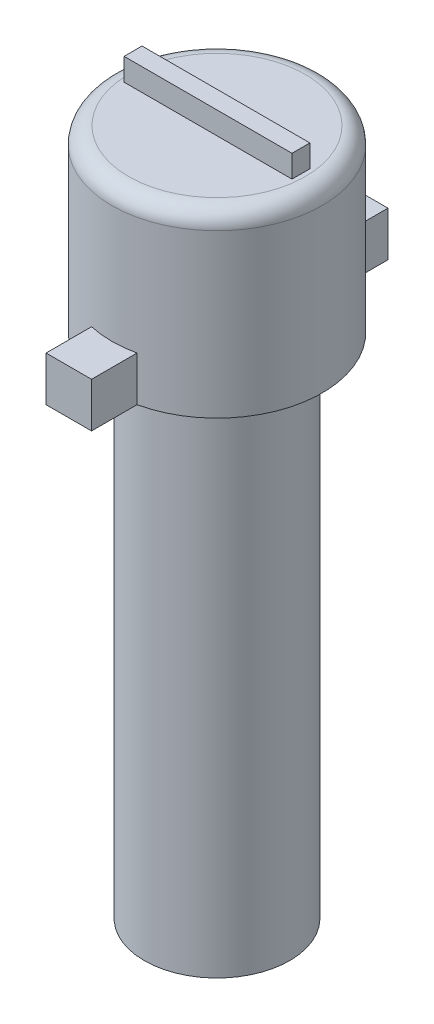
ISO-10303-21;
HEADER;
FILE_DESCRIPTION(('STEP AP214'),'2;1');
FILE_NAME('part.step','',(''),(''),'','','');
FILE_SCHEMA(('AUTOMOTIVE_DESIGN { 1 0 10303 214 1 1 1 1 }'));
ENDSEC;
DATA;
#1=APPLICATION_CONTEXT('core data for automotive mechanical design processes');
#2=APPLICATION_PROTOCOL_DEFINITION('international standard','automotive_design',2000,#1);
#3=PRODUCT_CONTEXT('',#1,'mechanical');
#4=PRODUCT('Part','Part','',(#3));
#5=PRODUCT_RELATED_PRODUCT_CATEGORY('part','',(#4));
#6=PRODUCT_DEFINITION_FORMATION('','',#4);
#7=PRODUCT_DEFINITION_CONTEXT('part definition',#1,'design');
#8=PRODUCT_DEFINITION('design','',#6,#7);
#9=PRODUCT_DEFINITION_SHAPE('','',#8);
#10=(LENGTH_UNIT() NAMED_UNIT(*) SI_UNIT(.MILLI.,.METRE.));
#11=(NAMED_UNIT(*) PLANE_ANGLE_UNIT() SI_UNIT($,.RADIAN.));
#12=(NAMED_UNIT(*) SI_UNIT($,.STERADIAN.) SOLID_ANGLE_UNIT());
#13=UNCERTAINTY_MEASURE_WITH_UNIT(LENGTH_MEASURE(1.E-05),#10,'distance_accuracy_value','');
#14=(GEOMETRIC_REPRESENTATION_CONTEXT(3) GLOBAL_UNCERTAINTY_ASSIGNED_CONTEXT((#13)) GLOBAL_UNIT_ASSIGNED_CONTEXT((#10,
#11,#12)) REPRESENTATION_CONTEXT('',''));
#15=CARTESIAN_POINT('',(0.,0.,0.));
#16=DIRECTION('',(0.,0.,1.));
#17=DIRECTION('',(1.,0.,0.));
#18=AXIS2_PLACEMENT_3D('',#15,#16,#17);
#19=CARTESIAN_POINT('',(0.,30.686,0.));
#20=DIRECTION('',(0.,-1.,0.));
#21=DIRECTION('',(0.,0.,-1.));
#22=AXIS2_PLACEMENT_3D('',#19,#20,#21);
#23=CYLINDRICAL_SURFACE('',#22,4.7);
#24=CARTESIAN_POINT('',(0.,29.936,0.));
#25=DIRECTION('',(0.,1.,0.));
#26=DIRECTION('',(0.,0.,1.));
#27=AXIS2_PLACEMENT_3D('',#24,#25,#26);
#28=CIRCLE('',#27,4.7);
#29=CARTESIAN_POINT('',(0.,29.936,4.7));
#30=VERTEX_POINT('',#29);
#31=EDGE_CURVE('E12',#30,#30,#28,.F.);
#32=ORIENTED_EDGE('',*,*,#31,.T.);
#33=EDGE_LOOP('',(#32));
#34=FACE_BOUND('',#33,.T.);
#35=DIRECTION('',(0.,-1.,0.));
#36=VECTOR('',#35,1.);
#37=CARTESIAN_POINT('',(1.016,24.686,4.58887175676113));
#38=LINE('',#37,#36);
#39=CARTESIAN_POINT('',(1.016,24.686,4.58887175676113));
#40=VERTEX_POINT('',#39);
#41=CARTESIAN_POINT('',(1.016,22.686,4.58887175676113));
#42=VERTEX_POINT('',#41);
#43=EDGE_CURVE('E179',#40,#42,#38,.T.);
#44=ORIENTED_EDGE('',*,*,#43,.T.);
#45=CARTESIAN_POINT('',(0.,22.686,0.));
#46=DIRECTION('',(0.,1.,0.));
#47=DIRECTION('',(0.,0.,1.));
#48=AXIS2_PLACEMENT_3D('',#45,#46,#47);
#49=CIRCLE('',#48,4.7);
#50=CARTESIAN_POINT('',(1.016,22.686,-4.58887175676113));
#51=VERTEX_POINT('',#50);
#52=EDGE_CURVE('E288',#42,#51,#49,.T.);
#53=ORIENTED_EDGE('',*,*,#52,.T.);
#54=DIRECTION('',(0.,-1.,0.));
#55=VECTOR('',#54,1.);
#56=CARTESIAN_POINT('',(1.016,24.686,-4.58887175676113));
#57=LINE('',#56,#55);
#58=CARTESIAN_POINT('',(1.016,24.686,-4.58887175676113));
#59=VERTEX_POINT('',#58);
#60=EDGE_CURVE('E193',#59,#51,#57,.T.);
#61=ORIENTED_EDGE('',*,*,#60,.F.);
#62=CARTESIAN_POINT('',(0.,24.686,0.));
#63=DIRECTION('',(0.,-1.,0.));
#64=DIRECTION('',(0.,0.,-1.));
#65=AXIS2_PLACEMENT_3D('',#62,#63,#64);
#66=CIRCLE('',#65,4.7);
#67=CARTESIAN_POINT('',(-1.016,24.686,-4.58887175676113));
#68=VERTEX_POINT('',#67);
#69=EDGE_CURVE('E203',#68,#59,#66,.T.);
#70=ORIENTED_EDGE('',*,*,#69,.F.);
#71=DIRECTION('',(0.,-1.,0.));
#72=VECTOR('',#71,1.);
#73=CARTESIAN_POINT('',(-1.016,24.686,-4.58887175676113));
#74=LINE('',#73,#72);
#75=CARTESIAN_POINT('',(-1.016,22.686,-4.58887175676113));
#76=VERTEX_POINT('',#75);
#77=EDGE_CURVE('E220',#68,#76,#74,.T.);
#78=ORIENTED_EDGE('',*,*,#77,.T.);
#79=CARTESIAN_POINT('',(-1.016,22.686,4.58887175676113));
#80=VERTEX_POINT('',#79);
#81=EDGE_CURVE('E287',#76,#80,#49,.T.);
#82=ORIENTED_EDGE('',*,*,#81,.T.);
#83=DIRECTION('',(0.,-1.,0.));
#84=VECTOR('',#83,1.);
#85=CARTESIAN_POINT('',(-1.016,24.686,4.58887175676113));
#86=LINE('',#85,#84);
#87=CARTESIAN_POINT('',(-1.016,24.686,4.58887175676113));
#88=VERTEX_POINT('',#87);
#89=EDGE_CURVE('E82',#88,#80,#86,.T.);
#90=ORIENTED_EDGE('',*,*,#89,.F.);
#91=CARTESIAN_POINT('',(0.,24.686,0.));
#92=DIRECTION('',(0.,-1.,0.));
#93=DIRECTION('',(0.,0.,-1.));
#94=AXIS2_PLACEMENT_3D('',#91,#92,#93);
#95=CIRCLE('',#94,4.7);
#96=EDGE_CURVE('E86',#40,#88,#95,.T.);
#97=ORIENTED_EDGE('',*,*,#96,.F.);
#98=EDGE_LOOP('',(#44,#53,#61,#70,#78,#82,#90,#97));
#99=FACE_BOUND('',#98,.T.);
#100=ADVANCED_FACE('F66',(#34,#99),#23,.T.);
#101=CARTESIAN_POINT('',(0.,31.686,0.));
#102=DIRECTION('',(0.,1.,0.));
#103=DIRECTION('',(0.,0.,1.));
#104=AXIS2_PLACEMENT_3D('',#101,#102,#103);
#105=PLANE('',#104);
#106=DIRECTION('',(0.,0.,-1.));
#107=VECTOR('',#106,1.);
#108=CARTESIAN_POINT('',(3.75,31.686,0.400000000000001));
#109=LINE('',#108,#107);
#110=CARTESIAN_POINT('',(3.75,31.686,0.400000000000001));
#111=VERTEX_POINT('',#110);
#112=CARTESIAN_POINT('',(3.75,31.686,-0.399999999999999));
#113=VERTEX_POINT('',#112);
#114=EDGE_CURVE('E254',#111,#113,#109,.T.);
#115=ORIENTED_EDGE('',*,*,#114,.T.);
#116=DIRECTION('',(-1.,0.,0.));
#117=VECTOR('',#116,1.);
#118=CARTESIAN_POINT('',(-0.4,31.686,-0.399999999999999));
#119=LINE('',#118,#117);
#120=CARTESIAN_POINT('',(-3.75,31.686,-0.399999999999999));
#121=VERTEX_POINT('',#120);
#122=EDGE_CURVE('E244',#113,#121,#119,.T.);
#123=ORIENTED_EDGE('',*,*,#122,.T.);
#124=DIRECTION('',(0.,0.,1.));
#125=VECTOR('',#124,1.);
#126=CARTESIAN_POINT('',(-3.75,31.686,-0.399999999999999));
#127=LINE('',#126,#125);
#128=CARTESIAN_POINT('',(-3.75,31.686,0.400000000000001));
#129=VERTEX_POINT('',#128);
#130=EDGE_CURVE('E247',#121,#129,#127,.T.);
#131=ORIENTED_EDGE('',*,*,#130,.T.);
#132=DIRECTION('',(1.,0.,0.));
#133=VECTOR('',#132,1.);
#134=CARTESIAN_POINT('',(-3.75,31.686,0.400000000000001));
#135=LINE('',#134,#133);
#136=EDGE_CURVE('E251',#129,#111,#135,.T.);
#137=ORIENTED_EDGE('',*,*,#136,.T.);
#138=EDGE_LOOP('',(#115,#123,#131,#137));
#139=FACE_BOUND('',#138,.T.);
#140=ADVANCED_FACE('F322',(#139),#105,.T.);
#141=CARTESIAN_POINT('',(0.,22.686,0.));
#142=DIRECTION('',(0.,-1.,0.));
#143=DIRECTION('',(0.,0.,-1.));
#144=AXIS2_PLACEMENT_3D('',#141,#142,#143);
#145=CYLINDRICAL_SURFACE('',#144,3.25);
#146=CARTESIAN_POINT('',(0.,22.686,0.));
#147=DIRECTION('',(0.,1.,0.));
#148=DIRECTION('',(0.,0.,1.));
#149=AXIS2_PLACEMENT_3D('',#146,#147,#148);
#150=CIRCLE('',#149,3.25);
#151=CARTESIAN_POINT('',(0.,22.686,3.25));
#152=VERTEX_POINT('',#151);
#153=EDGE_CURVE('E292',#152,#152,#150,.T.);
#154=ORIENTED_EDGE('',*,*,#153,.F.);
#155=EDGE_LOOP('',(#154));
#156=FACE_BOUND('',#155,.T.);
#157=CARTESIAN_POINT('',(0.,0.,0.));
#158=DIRECTION('',(0.,1.,0.));
#159=DIRECTION('',(0.,0.,1.));
#160=AXIS2_PLACEMENT_3D('',#157,#158,#159);
#161=CIRCLE('',#160,3.25);
#162=CARTESIAN_POINT('',(0.,0.,3.25));
#163=VERTEX_POINT('',#162);
#164=EDGE_CURVE('E291',#163,#163,#161,.T.);
#165=ORIENTED_EDGE('',*,*,#164,.T.);
#166=EDGE_LOOP('',(#165));
#167=FACE_BOUND('',#166,.T.);
#168=ADVANCED_FACE('F329',(#156,#167),#145,.T.);
#169=CARTESIAN_POINT('',(0.,0.,0.));
#170=DIRECTION('',(0.,1.,0.));
#171=DIRECTION('',(0.,0.,1.));
#172=AXIS2_PLACEMENT_3D('',#169,#170,#171);
#173=PLANE('',#172);
#174=ORIENTED_EDGE('',*,*,#164,.F.);
#175=EDGE_LOOP('',(#174));
#176=FACE_BOUND('',#175,.T.);
#177=ADVANCED_FACE('F336',(#176),#173,.F.);
#178=CARTESIAN_POINT('',(0.,30.686,0.));
#179=DIRECTION('',(0.,1.,0.));
#180=DIRECTION('',(0.,0.,1.));
#181=AXIS2_PLACEMENT_3D('',#178,#179,#180);
#182=PLANE('',#181);
#183=CARTESIAN_POINT('',(0.,30.686,0.));
#184=DIRECTION('',(0.,1.,0.));
#185=DIRECTION('',(0.,0.,1.));
#186=AXIS2_PLACEMENT_3D('',#183,#184,#185);
#187=CIRCLE('',#186,3.95);
#188=CARTESIAN_POINT('',(0.,30.686,3.95));
#189=VERTEX_POINT('',#188);
#190=EDGE_CURVE('E75',#189,#189,#187,.T.);
#191=ORIENTED_EDGE('',*,*,#190,.T.);
#192=EDGE_LOOP('',(#191));
#193=FACE_BOUND('',#192,.T.);
#194=DIRECTION('',(-1.,0.,0.));
#195=VECTOR('',#194,1.);
#196=CARTESIAN_POINT('',(-0.4,30.686,-0.399999999999999));
#197=LINE('',#196,#195);
#198=CARTESIAN_POINT('',(3.75,30.686,-0.399999999999999));
#199=VERTEX_POINT('',#198);
#200=CARTESIAN_POINT('',(-3.75,30.686,-0.399999999999999));
#201=VERTEX_POINT('',#200);
#202=EDGE_CURVE('E198',#199,#201,#197,.T.);
#203=ORIENTED_EDGE('',*,*,#202,.F.);
#204=DIRECTION('',(0.,0.,-1.));
#205=VECTOR('',#204,1.);
#206=CARTESIAN_POINT('',(3.75,30.686,0.400000000000001));
#207=LINE('',#206,#205);
#208=CARTESIAN_POINT('',(3.75,30.686,0.400000000000001));
#209=VERTEX_POINT('',#208);
#210=EDGE_CURVE('E248',#209,#199,#207,.T.);
#211=ORIENTED_EDGE('',*,*,#210,.F.);
#212=DIRECTION('',(1.,0.,0.));
#213=VECTOR('',#212,1.);
#214=CARTESIAN_POINT('',(-3.75,30.686,0.400000000000001));
#215=LINE('',#214,#213);
#216=CARTESIAN_POINT('',(-3.75,30.686,0.400000000000001));
#217=VERTEX_POINT('',#216);
#218=EDGE_CURVE('E266',#217,#209,#215,.T.);
#219=ORIENTED_EDGE('',*,*,#218,.F.);
#220=DIRECTION('',(0.,0.,1.));
#221=VECTOR('',#220,1.);
#222=CARTESIAN_POINT('',(-3.75,30.686,-0.399999999999999));
#223=LINE('',#222,#221);
#224=EDGE_CURVE('E262',#201,#217,#223,.T.);
#225=ORIENTED_EDGE('',*,*,#224,.F.);
#226=EDGE_LOOP('',(#203,#211,#219,#225));
#227=FACE_BOUND('',#226,.T.);
#228=ADVANCED_FACE('F302',(#193,#227),#182,.T.);
#229=CARTESIAN_POINT('',(0.,22.686,0.));
#230=DIRECTION('',(0.,1.,0.));
#231=DIRECTION('',(0.,0.,1.));
#232=AXIS2_PLACEMENT_3D('',#229,#230,#231);
#233=PLANE('',#232);
#234=ORIENTED_EDGE('',*,*,#153,.T.);
#235=EDGE_LOOP('',(#234));
#236=FACE_BOUND('',#235,.T.);
#237=ORIENTED_EDGE('',*,*,#52,.F.);
#238=DIRECTION('',(0.,0.,-1.));
#239=VECTOR('',#238,1.);
#240=CARTESIAN_POINT('',(1.016,22.686,0.));
#241=LINE('',#240,#239);
#242=CARTESIAN_POINT('',(1.016,22.686,6.62087175676113));
#243=VERTEX_POINT('',#242);
#244=EDGE_CURVE('E190',#243,#42,#241,.T.);
#245=ORIENTED_EDGE('',*,*,#244,.F.);
#246=DIRECTION('',(1.,0.,0.));
#247=VECTOR('',#246,1.);
#248=CARTESIAN_POINT('',(0.,22.686,6.62087175676113));
#249=LINE('',#248,#247);
#250=CARTESIAN_POINT('',(-1.016,22.686,6.62087175676113));
#251=VERTEX_POINT('',#250);
#252=EDGE_CURVE('E171',#251,#243,#249,.T.);
#253=ORIENTED_EDGE('',*,*,#252,.F.);
#254=DIRECTION('',(0.,0.,1.));
#255=VECTOR('',#254,1.);
#256=CARTESIAN_POINT('',(-1.016,22.686,0.));
#257=LINE('',#256,#255);
#258=EDGE_CURVE('E181',#80,#251,#257,.T.);
#259=ORIENTED_EDGE('',*,*,#258,.F.);
#260=ORIENTED_EDGE('',*,*,#81,.F.);
#261=DIRECTION('',(0.,0.,-1.));
#262=VECTOR('',#261,1.);
#263=CARTESIAN_POINT('',(-1.016,22.686,0.));
#264=LINE('',#263,#262);
#265=CARTESIAN_POINT('',(-1.016,22.686,-6.62087175676113));
#266=VERTEX_POINT('',#265);
#267=EDGE_CURVE('E221',#76,#266,#264,.T.);
#268=ORIENTED_EDGE('',*,*,#267,.T.);
#269=DIRECTION('',(1.,0.,0.));
#270=VECTOR('',#269,1.);
#271=CARTESIAN_POINT('',(0.,22.686,-6.62087175676113));
#272=LINE('',#271,#270);
#273=CARTESIAN_POINT('',(1.016,22.686,-6.62087175676113));
#274=VERTEX_POINT('',#273);
#275=EDGE_CURVE('E225',#266,#274,#272,.T.);
#276=ORIENTED_EDGE('',*,*,#275,.T.);
#277=DIRECTION('',(0.,0.,1.));
#278=VECTOR('',#277,1.);
#279=CARTESIAN_POINT('',(1.016,22.686,0.));
#280=LINE('',#279,#278);
#281=EDGE_CURVE('E208',#274,#51,#280,.T.);
#282=ORIENTED_EDGE('',*,*,#281,.T.);
#283=EDGE_LOOP('',(#237,#245,#253,#259,#260,#268,#276,#282));
#284=FACE_BOUND('',#283,.T.);
#285=ADVANCED_FACE('F334',(#236,#284),#233,.F.);
#286=CARTESIAN_POINT('',(-0.4,31.686,-0.399999999999999));
#287=DIRECTION('',(0.,0.,1.));
#288=DIRECTION('',(1.,0.,0.));
#289=AXIS2_PLACEMENT_3D('',#286,#287,#288);
#290=PLANE('',#289);
#291=ORIENTED_EDGE('',*,*,#202,.T.);
#292=DIRECTION('',(0.,-1.,0.));
#293=VECTOR('',#292,1.);
#294=CARTESIAN_POINT('',(-3.75,31.686,-0.399999999999999));
#295=LINE('',#294,#293);
#296=EDGE_CURVE('E283',#121,#201,#295,.T.);
#297=ORIENTED_EDGE('',*,*,#296,.F.);
#298=ORIENTED_EDGE('',*,*,#122,.F.);
#299=DIRECTION('',(0.,-1.,0.));
#300=VECTOR('',#299,1.);
#301=CARTESIAN_POINT('',(3.75,31.686,-0.399999999999999));
#302=LINE('',#301,#300);
#303=EDGE_CURVE('E258',#113,#199,#302,.T.);
#304=ORIENTED_EDGE('',*,*,#303,.T.);
#305=EDGE_LOOP('',(#291,#297,#298,#304));
#306=FACE_BOUND('',#305,.T.);
#307=ADVANCED_FACE('F348',(#306),#290,.F.);
#308=CARTESIAN_POINT('',(-3.75,31.686,-0.399999999999999));
#309=DIRECTION('',(1.,0.,0.));
#310=DIRECTION('',(0.,0.,-1.));
#311=AXIS2_PLACEMENT_3D('',#308,#309,#310);
#312=PLANE('',#311);
#313=ORIENTED_EDGE('',*,*,#224,.T.);
#314=DIRECTION('',(0.,-1.,0.));
#315=VECTOR('',#314,1.);
#316=CARTESIAN_POINT('',(-3.75,31.686,0.400000000000001));
#317=LINE('',#316,#315);
#318=EDGE_CURVE('E279',#129,#217,#317,.T.);
#319=ORIENTED_EDGE('',*,*,#318,.F.);
#320=ORIENTED_EDGE('',*,*,#130,.F.);
#321=ORIENTED_EDGE('',*,*,#296,.T.);
#322=EDGE_LOOP('',(#313,#319,#320,#321));
#323=FACE_BOUND('',#322,.T.);
#324=ADVANCED_FACE('F382',(#323),#312,.F.);
#325=CARTESIAN_POINT('',(-3.75,31.686,0.400000000000001));
#326=DIRECTION('',(0.,0.,-1.));
#327=DIRECTION('',(-1.,0.,0.));
#328=AXIS2_PLACEMENT_3D('',#325,#326,#327);
#329=PLANE('',#328);
#330=ORIENTED_EDGE('',*,*,#218,.T.);
#331=DIRECTION('',(0.,-1.,0.));
#332=VECTOR('',#331,1.);
#333=CARTESIAN_POINT('',(3.75,31.686,0.400000000000001));
#334=LINE('',#333,#332);
#335=EDGE_CURVE('E275',#111,#209,#334,.T.);
#336=ORIENTED_EDGE('',*,*,#335,.F.);
#337=ORIENTED_EDGE('',*,*,#136,.F.);
#338=ORIENTED_EDGE('',*,*,#318,.T.);
#339=EDGE_LOOP('',(#330,#336,#337,#338));
#340=FACE_BOUND('',#339,.T.);
#341=ADVANCED_FACE('F317',(#340),#329,.F.);
#342=CARTESIAN_POINT('',(3.75,31.686,0.400000000000001));
#343=DIRECTION('',(-1.,0.,0.));
#344=DIRECTION('',(0.,0.,1.));
#345=AXIS2_PLACEMENT_3D('',#342,#343,#344);
#346=PLANE('',#345);
#347=ORIENTED_EDGE('',*,*,#210,.T.);
#348=ORIENTED_EDGE('',*,*,#303,.F.);
#349=ORIENTED_EDGE('',*,*,#114,.F.);
#350=ORIENTED_EDGE('',*,*,#335,.T.);
#351=EDGE_LOOP('',(#347,#348,#349,#350));
#352=FACE_BOUND('',#351,.T.);
#353=ADVANCED_FACE('F307',(#352),#346,.F.);
#354=CARTESIAN_POINT('',(0.,29.936,0.));
#355=DIRECTION('',(0.,1.,0.));
#356=DIRECTION('',(0.,0.,1.));
#357=AXIS2_PLACEMENT_3D('',#354,#355,#356);
#358=TOROIDAL_SURFACE('',#357,3.95,0.75);
#359=ORIENTED_EDGE('',*,*,#31,.F.);
#360=EDGE_LOOP('',(#359));
#361=FACE_BOUND('',#360,.T.);
#362=ORIENTED_EDGE('',*,*,#190,.F.);
#363=EDGE_LOOP('',(#362));
#364=FACE_BOUND('',#363,.T.);
#365=ADVANCED_FACE('F68',(#361,#364),#358,.T.);
#366=CARTESIAN_POINT('',(1.016,24.686,0.));
#367=DIRECTION('',(1.,0.,0.));
#368=DIRECTION('',(0.,0.,-1.));
#369=AXIS2_PLACEMENT_3D('',#366,#367,#368);
#370=PLANE('',#369);
#371=ORIENTED_EDGE('',*,*,#281,.F.);
#372=DIRECTION('',(0.,-1.,0.));
#373=VECTOR('',#372,1.);
#374=CARTESIAN_POINT('',(1.016,24.686,-6.62087175676113));
#375=LINE('',#374,#373);
#376=CARTESIAN_POINT('',(1.016,24.686,-6.62087175676113));
#377=VERTEX_POINT('',#376);
#378=EDGE_CURVE('E235',#377,#274,#375,.T.);
#379=ORIENTED_EDGE('',*,*,#378,.F.);
#380=DIRECTION('',(0.,0.,1.));
#381=VECTOR('',#380,1.);
#382=CARTESIAN_POINT('',(1.016,24.686,0.));
#383=LINE('',#382,#381);
#384=EDGE_CURVE('E216',#377,#59,#383,.T.);
#385=ORIENTED_EDGE('',*,*,#384,.T.);
#386=ORIENTED_EDGE('',*,*,#60,.T.);
#387=EDGE_LOOP('',(#371,#379,#385,#386));
#388=FACE_BOUND('',#387,.T.);
#389=ADVANCED_FACE('F306',(#388),#370,.T.);
#390=CARTESIAN_POINT('',(0.,24.686,-6.62087175676113));
#391=DIRECTION('',(0.,0.,-1.));
#392=DIRECTION('',(-1.,0.,0.));
#393=AXIS2_PLACEMENT_3D('',#390,#391,#392);
#394=PLANE('',#393);
#395=ORIENTED_EDGE('',*,*,#275,.F.);
#396=DIRECTION('',(0.,-1.,0.));
#397=VECTOR('',#396,1.);
#398=CARTESIAN_POINT('',(-1.016,24.686,-6.62087175676113));
#399=LINE('',#398,#397);
#400=CARTESIAN_POINT('',(-1.016,24.686,-6.62087175676113));
#401=VERTEX_POINT('',#400);
#402=EDGE_CURVE('E238',#401,#266,#399,.T.);
#403=ORIENTED_EDGE('',*,*,#402,.F.);
#404=DIRECTION('',(1.,0.,0.));
#405=VECTOR('',#404,1.);
#406=CARTESIAN_POINT('',(0.,24.686,-6.62087175676113));
#407=LINE('',#406,#405);
#408=EDGE_CURVE('E212',#401,#377,#407,.T.);
#409=ORIENTED_EDGE('',*,*,#408,.T.);
#410=ORIENTED_EDGE('',*,*,#378,.T.);
#411=EDGE_LOOP('',(#395,#403,#409,#410));
#412=FACE_BOUND('',#411,.T.);
#413=ADVANCED_FACE('F314',(#412),#394,.T.);
#414=CARTESIAN_POINT('',(-1.016,24.686,0.));
#415=DIRECTION('',(-1.,0.,0.));
#416=DIRECTION('',(0.,0.,1.));
#417=AXIS2_PLACEMENT_3D('',#414,#415,#416);
#418=PLANE('',#417);
#419=ORIENTED_EDGE('',*,*,#267,.F.);
#420=ORIENTED_EDGE('',*,*,#77,.F.);
#421=DIRECTION('',(0.,0.,-1.));
#422=VECTOR('',#421,1.);
#423=CARTESIAN_POINT('',(-1.016,24.686,0.));
#424=LINE('',#423,#422);
#425=EDGE_CURVE('E207',#68,#401,#424,.T.);
#426=ORIENTED_EDGE('',*,*,#425,.T.);
#427=ORIENTED_EDGE('',*,*,#402,.T.);
#428=EDGE_LOOP('',(#419,#420,#426,#427));
#429=FACE_BOUND('',#428,.T.);
#430=ADVANCED_FACE('F358',(#429),#418,.T.);
#431=CARTESIAN_POINT('',(0.,24.686,0.));
#432=DIRECTION('',(0.,-1.,0.));
#433=DIRECTION('',(0.,0.,-1.));
#434=AXIS2_PLACEMENT_3D('',#431,#432,#433);
#435=PLANE('',#434);
#436=ORIENTED_EDGE('',*,*,#69,.T.);
#437=ORIENTED_EDGE('',*,*,#384,.F.);
#438=ORIENTED_EDGE('',*,*,#408,.F.);
#439=ORIENTED_EDGE('',*,*,#425,.F.);
#440=EDGE_LOOP('',(#436,#437,#438,#439));
#441=FACE_BOUND('',#440,.T.);
#442=ADVANCED_FACE('F353',(#441),#435,.F.);
#443=CARTESIAN_POINT('',(1.016,24.686,0.));
#444=DIRECTION('',(-1.,0.,0.));
#445=DIRECTION('',(0.,0.,1.));
#446=AXIS2_PLACEMENT_3D('',#443,#444,#445);
#447=PLANE('',#446);
#448=ORIENTED_EDGE('',*,*,#244,.T.);
#449=ORIENTED_EDGE('',*,*,#43,.F.);
#450=DIRECTION('',(0.,0.,-1.));
#451=VECTOR('',#450,1.);
#452=CARTESIAN_POINT('',(1.016,24.686,0.));
#453=LINE('',#452,#451);
#454=CARTESIAN_POINT('',(1.016,24.686,6.62087175676113));
#455=VERTEX_POINT('',#454);
#456=EDGE_CURVE('E158',#455,#40,#453,.T.);
#457=ORIENTED_EDGE('',*,*,#456,.F.);
#458=DIRECTION('',(0.,-1.,0.));
#459=VECTOR('',#458,1.);
#460=CARTESIAN_POINT('',(1.016,24.686,6.62087175676113));
#461=LINE('',#460,#459);
#462=EDGE_CURVE('E168',#455,#243,#461,.T.);
#463=ORIENTED_EDGE('',*,*,#462,.T.);
#464=EDGE_LOOP('',(#448,#449,#457,#463));
#465=FACE_BOUND('',#464,.T.);
#466=ADVANCED_FACE('F178',(#465),#447,.F.);
#467=CARTESIAN_POINT('',(-1.016,24.686,0.));
#468=DIRECTION('',(1.,0.,0.));
#469=DIRECTION('',(0.,0.,-1.));
#470=AXIS2_PLACEMENT_3D('',#467,#468,#469);
#471=PLANE('',#470);
#472=ORIENTED_EDGE('',*,*,#258,.T.);
#473=DIRECTION('',(0.,-1.,0.));
#474=VECTOR('',#473,1.);
#475=CARTESIAN_POINT('',(-1.016,24.686,6.62087175676113));
#476=LINE('',#475,#474);
#477=CARTESIAN_POINT('',(-1.016,24.686,6.62087175676113));
#478=VERTEX_POINT('',#477);
#479=EDGE_CURVE('E176',#478,#251,#476,.T.);
#480=ORIENTED_EDGE('',*,*,#479,.F.);
#481=DIRECTION('',(0.,0.,1.));
#482=VECTOR('',#481,1.);
#483=CARTESIAN_POINT('',(-1.016,24.686,0.));
#484=LINE('',#483,#482);
#485=EDGE_CURVE('E161',#88,#478,#484,.T.);
#486=ORIENTED_EDGE('',*,*,#485,.F.);
#487=ORIENTED_EDGE('',*,*,#89,.T.);
#488=EDGE_LOOP('',(#472,#480,#486,#487));
#489=FACE_BOUND('',#488,.T.);
#490=ADVANCED_FACE('F363',(#489),#471,.F.);
#491=CARTESIAN_POINT('',(0.,24.686,6.62087175676113));
#492=DIRECTION('',(0.,0.,-1.));
#493=DIRECTION('',(-1.,0.,0.));
#494=AXIS2_PLACEMENT_3D('',#491,#492,#493);
#495=PLANE('',#494);
#496=ORIENTED_EDGE('',*,*,#252,.T.);
#497=ORIENTED_EDGE('',*,*,#462,.F.);
#498=DIRECTION('',(1.,0.,0.));
#499=VECTOR('',#498,1.);
#500=CARTESIAN_POINT('',(0.,24.686,6.62087175676113));
#501=LINE('',#500,#499);
#502=EDGE_CURVE('E154',#478,#455,#501,.T.);
#503=ORIENTED_EDGE('',*,*,#502,.F.);
#504=ORIENTED_EDGE('',*,*,#479,.T.);
#505=EDGE_LOOP('',(#496,#497,#503,#504));
#506=FACE_BOUND('',#505,.T.);
#507=ADVANCED_FACE('F169',(#506),#495,.F.);
#508=CARTESIAN_POINT('',(0.,24.686,0.));
#509=DIRECTION('',(0.,-1.,0.));
#510=DIRECTION('',(0.,0.,-1.));
#511=AXIS2_PLACEMENT_3D('',#508,#509,#510);
#512=PLANE('',#511);
#513=ORIENTED_EDGE('',*,*,#456,.T.);
#514=ORIENTED_EDGE('',*,*,#96,.T.);
#515=ORIENTED_EDGE('',*,*,#485,.T.);
#516=ORIENTED_EDGE('',*,*,#502,.T.);
#517=EDGE_LOOP('',(#513,#514,#515,#516));
#518=FACE_BOUND('',#517,.T.);
#519=ADVANCED_FACE('F156',(#518),#512,.F.);
#520=CLOSED_SHELL('',(#100,#140,#168,#177,#228,#285,#307,#324,#341,#353,#365,#389,#413,#430,
#442,#466,#490,#507,#519));
#521=MANIFOLD_SOLID_BREP('B2',#520);
#522=ADVANCED_BREP_SHAPE_REPRESENTATION('',(#18,#521),#14);
#523=SHAPE_DEFINITION_REPRESENTATION(#9,#522);
ENDSEC;
END-ISO-10303-21;
